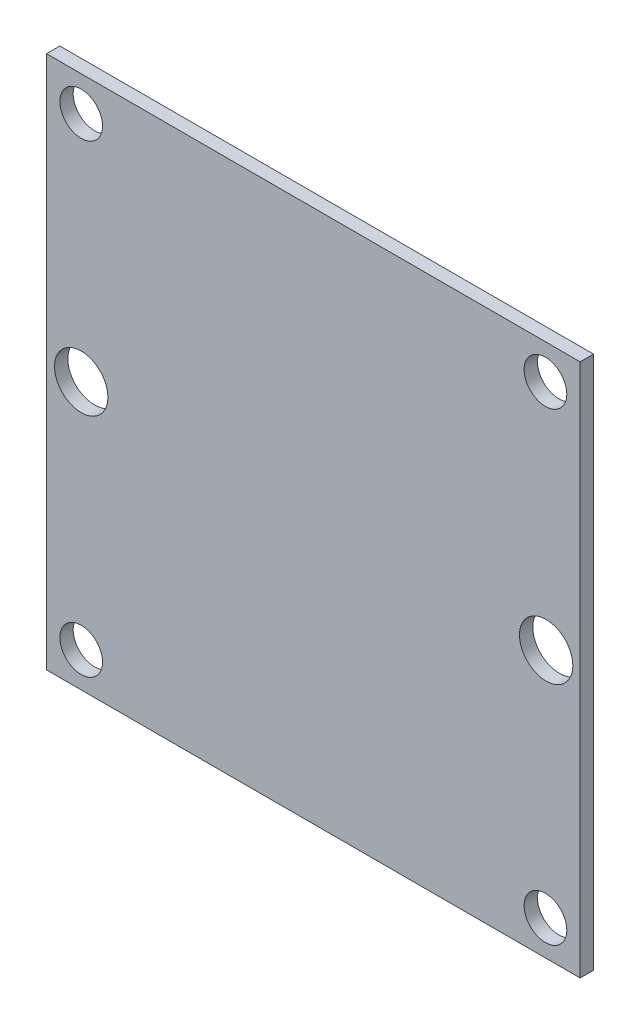
ISO-10303-21;
HEADER;
FILE_DESCRIPTION(('STEP AP214'),'2;1');
FILE_NAME('part.step','',(''),(''),'','','');
FILE_SCHEMA(('AUTOMOTIVE_DESIGN { 1 0 10303 214 1 1 1 1 }'));
ENDSEC;
DATA;
#1=APPLICATION_CONTEXT('core data for automotive mechanical design processes');
#2=APPLICATION_PROTOCOL_DEFINITION('international standard','automotive_design',2000,#1);
#3=PRODUCT_CONTEXT('',#1,'mechanical');
#4=PRODUCT('Part','Part','',(#3));
#5=PRODUCT_RELATED_PRODUCT_CATEGORY('part','',(#4));
#6=PRODUCT_DEFINITION_FORMATION('','',#4);
#7=PRODUCT_DEFINITION_CONTEXT('part definition',#1,'design');
#8=PRODUCT_DEFINITION('design','',#6,#7);
#9=PRODUCT_DEFINITION_SHAPE('','',#8);
#10=(LENGTH_UNIT() NAMED_UNIT(*) SI_UNIT(.MILLI.,.METRE.));
#11=(NAMED_UNIT(*) PLANE_ANGLE_UNIT() SI_UNIT($,.RADIAN.));
#12=(NAMED_UNIT(*) SI_UNIT($,.STERADIAN.) SOLID_ANGLE_UNIT());
#13=UNCERTAINTY_MEASURE_WITH_UNIT(LENGTH_MEASURE(1.E-05),#10,'distance_accuracy_value','');
#14=(GEOMETRIC_REPRESENTATION_CONTEXT(3) GLOBAL_UNCERTAINTY_ASSIGNED_CONTEXT((#13)) GLOBAL_UNIT_ASSIGNED_CONTEXT((#10,
#11,#12)) REPRESENTATION_CONTEXT('',''));
#15=CARTESIAN_POINT('',(0.,0.,0.));
#16=DIRECTION('',(0.,0.,1.));
#17=DIRECTION('',(1.,0.,0.));
#18=AXIS2_PLACEMENT_3D('',#15,#16,#17);
#19=CARTESIAN_POINT('',(20.,20.,1.));
#20=DIRECTION('',(-1.,0.,0.));
#21=DIRECTION('',(0.,0.,1.));
#22=AXIS2_PLACEMENT_3D('',#19,#20,#21);
#23=PLANE('',#22);
#24=DIRECTION('',(0.,1.,0.));
#25=VECTOR('',#24,1.);
#26=CARTESIAN_POINT('',(20.,20.,0.));
#27=LINE('',#26,#25);
#28=CARTESIAN_POINT('',(20.,-20.,0.));
#29=VERTEX_POINT('',#28);
#30=CARTESIAN_POINT('',(20.,20.,0.));
#31=VERTEX_POINT('',#30);
#32=EDGE_CURVE('E98',#29,#31,#27,.T.);
#33=ORIENTED_EDGE('',*,*,#32,.T.);
#34=DIRECTION('',(0.,0.,-1.));
#35=VECTOR('',#34,1.);
#36=CARTESIAN_POINT('',(20.,20.,1.));
#37=LINE('',#36,#35);
#38=CARTESIAN_POINT('',(20.,20.,1.));
#39=VERTEX_POINT('',#38);
#40=EDGE_CURVE('E11',#39,#31,#37,.T.);
#41=ORIENTED_EDGE('',*,*,#40,.F.);
#42=DIRECTION('',(0.,1.,0.));
#43=VECTOR('',#42,1.);
#44=CARTESIAN_POINT('',(20.,20.,1.));
#45=LINE('',#44,#43);
#46=CARTESIAN_POINT('',(20.,-20.,1.));
#47=VERTEX_POINT('',#46);
#48=EDGE_CURVE('E85',#47,#39,#45,.T.);
#49=ORIENTED_EDGE('',*,*,#48,.F.);
#50=DIRECTION('',(0.,0.,-1.));
#51=VECTOR('',#50,1.);
#52=CARTESIAN_POINT('',(20.,-20.,1.));
#53=LINE('',#52,#51);
#54=EDGE_CURVE('E94',#47,#29,#53,.T.);
#55=ORIENTED_EDGE('',*,*,#54,.T.);
#56=EDGE_LOOP('',(#33,#41,#49,#55));
#57=FACE_BOUND('',#56,.T.);
#58=ADVANCED_FACE('F32',(#57),#23,.F.);
#59=CARTESIAN_POINT('',(-20.,20.,1.));
#60=DIRECTION('',(0.,-1.,0.));
#61=DIRECTION('',(0.,0.,-1.));
#62=AXIS2_PLACEMENT_3D('',#59,#60,#61);
#63=PLANE('',#62);
#64=DIRECTION('',(-1.,0.,0.));
#65=VECTOR('',#64,1.);
#66=CARTESIAN_POINT('',(-20.,20.,0.));
#67=LINE('',#66,#65);
#68=CARTESIAN_POINT('',(-20.,20.,0.));
#69=VERTEX_POINT('',#68);
#70=EDGE_CURVE('E89',#31,#69,#67,.T.);
#71=ORIENTED_EDGE('',*,*,#70,.T.);
#72=DIRECTION('',(0.,0.,-1.));
#73=VECTOR('',#72,1.);
#74=CARTESIAN_POINT('',(-20.,20.,1.));
#75=LINE('',#74,#73);
#76=CARTESIAN_POINT('',(-20.,20.,1.));
#77=VERTEX_POINT('',#76);
#78=EDGE_CURVE('E41',#77,#69,#75,.T.);
#79=ORIENTED_EDGE('',*,*,#78,.F.);
#80=DIRECTION('',(-1.,0.,0.));
#81=VECTOR('',#80,1.);
#82=CARTESIAN_POINT('',(-20.,20.,1.));
#83=LINE('',#82,#81);
#84=EDGE_CURVE('E80',#39,#77,#83,.T.);
#85=ORIENTED_EDGE('',*,*,#84,.F.);
#86=ORIENTED_EDGE('',*,*,#40,.T.);
#87=EDGE_LOOP('',(#71,#79,#85,#86));
#88=FACE_BOUND('',#87,.T.);
#89=ADVANCED_FACE('F88',(#88),#63,.F.);
#90=CARTESIAN_POINT('',(-20.,20.,1.));
#91=DIRECTION('',(1.,0.,0.));
#92=DIRECTION('',(0.,1.,0.));
#93=AXIS2_PLACEMENT_3D('',#90,#91,#92);
#94=PLANE('',#93);
#95=DIRECTION('',(0.,-1.,0.));
#96=VECTOR('',#95,1.);
#97=CARTESIAN_POINT('',(-20.,20.,0.));
#98=LINE('',#97,#96);
#99=CARTESIAN_POINT('',(-20.,-20.,0.));
#100=VERTEX_POINT('',#99);
#101=EDGE_CURVE('E67',#69,#100,#98,.T.);
#102=ORIENTED_EDGE('',*,*,#101,.T.);
#103=DIRECTION('',(0.,0.,-1.));
#104=VECTOR('',#103,1.);
#105=CARTESIAN_POINT('',(-20.,-20.,1.));
#106=LINE('',#105,#104);
#107=CARTESIAN_POINT('',(-20.,-20.,1.));
#108=VERTEX_POINT('',#107);
#109=EDGE_CURVE('E90',#108,#100,#106,.T.);
#110=ORIENTED_EDGE('',*,*,#109,.F.);
#111=DIRECTION('',(0.,-1.,0.));
#112=VECTOR('',#111,1.);
#113=CARTESIAN_POINT('',(-20.,20.,1.));
#114=LINE('',#113,#112);
#115=EDGE_CURVE('E83',#77,#108,#114,.T.);
#116=ORIENTED_EDGE('',*,*,#115,.F.);
#117=ORIENTED_EDGE('',*,*,#78,.T.);
#118=EDGE_LOOP('',(#102,#110,#116,#117));
#119=FACE_BOUND('',#118,.T.);
#120=ADVANCED_FACE('F92',(#119),#94,.F.);
#121=CARTESIAN_POINT('',(-20.,-20.,1.));
#122=DIRECTION('',(0.,1.,0.));
#123=DIRECTION('',(0.,0.,1.));
#124=AXIS2_PLACEMENT_3D('',#121,#122,#123);
#125=PLANE('',#124);
#126=DIRECTION('',(1.,0.,0.));
#127=VECTOR('',#126,1.);
#128=CARTESIAN_POINT('',(-20.,-20.,0.));
#129=LINE('',#128,#127);
#130=EDGE_CURVE('E73',#100,#29,#129,.T.);
#131=ORIENTED_EDGE('',*,*,#130,.T.);
#132=ORIENTED_EDGE('',*,*,#54,.F.);
#133=DIRECTION('',(1.,0.,0.));
#134=VECTOR('',#133,1.);
#135=CARTESIAN_POINT('',(-20.,-20.,1.));
#136=LINE('',#135,#134);
#137=EDGE_CURVE('E50',#108,#47,#136,.T.);
#138=ORIENTED_EDGE('',*,*,#137,.F.);
#139=ORIENTED_EDGE('',*,*,#109,.T.);
#140=EDGE_LOOP('',(#131,#132,#138,#139));
#141=FACE_BOUND('',#140,.T.);
#142=ADVANCED_FACE('F148',(#141),#125,.F.);
#143=CARTESIAN_POINT('',(0.,0.,1.));
#144=DIRECTION('',(0.,0.,1.));
#145=DIRECTION('',(1.,0.,0.));
#146=AXIS2_PLACEMENT_3D('',#143,#144,#145);
#147=PLANE('',#146);
#148=CARTESIAN_POINT('',(-17.4,0.,1.));
#149=DIRECTION('',(0.,0.,1.));
#150=DIRECTION('',(1.,0.,0.));
#151=AXIS2_PLACEMENT_3D('',#148,#149,#150);
#152=CIRCLE('',#151,2.);
#153=CARTESIAN_POINT('',(-15.4,0.,1.));
#154=VERTEX_POINT('',#153);
#155=EDGE_CURVE('E133',#154,#154,#152,.T.);
#156=ORIENTED_EDGE('',*,*,#155,.F.);
#157=EDGE_LOOP('',(#156));
#158=FACE_BOUND('',#157,.T.);
#159=CARTESIAN_POINT('',(17.4506505270837,0.,1.));
#160=DIRECTION('',(0.,0.,1.));
#161=DIRECTION('',(1.,0.,0.));
#162=AXIS2_PLACEMENT_3D('',#159,#160,#161);
#163=CIRCLE('',#162,2.);
#164=CARTESIAN_POINT('',(19.4506505270837,0.,1.));
#165=VERTEX_POINT('',#164);
#166=EDGE_CURVE('E123',#165,#165,#163,.T.);
#167=ORIENTED_EDGE('',*,*,#166,.F.);
#168=EDGE_LOOP('',(#167));
#169=FACE_BOUND('',#168,.T.);
#170=CARTESIAN_POINT('',(-17.4,17.4,1.));
#171=DIRECTION('',(0.,0.,1.));
#172=DIRECTION('',(1.,0.,0.));
#173=AXIS2_PLACEMENT_3D('',#170,#171,#172);
#174=CIRCLE('',#173,1.6);
#175=CARTESIAN_POINT('',(-15.8,17.4,1.));
#176=VERTEX_POINT('',#175);
#177=EDGE_CURVE('E120',#176,#176,#174,.T.);
#178=ORIENTED_EDGE('',*,*,#177,.F.);
#179=EDGE_LOOP('',(#178));
#180=FACE_BOUND('',#179,.T.);
#181=CARTESIAN_POINT('',(17.4,17.4,1.));
#182=DIRECTION('',(0.,0.,1.));
#183=DIRECTION('',(1.,0.,0.));
#184=AXIS2_PLACEMENT_3D('',#181,#182,#183);
#185=CIRCLE('',#184,1.6);
#186=CARTESIAN_POINT('',(19.,17.4,1.));
#187=VERTEX_POINT('',#186);
#188=EDGE_CURVE('E117',#187,#187,#185,.T.);
#189=ORIENTED_EDGE('',*,*,#188,.F.);
#190=EDGE_LOOP('',(#189));
#191=FACE_BOUND('',#190,.T.);
#192=CARTESIAN_POINT('',(17.4,-17.4,1.));
#193=DIRECTION('',(0.,0.,1.));
#194=DIRECTION('',(1.,0.,0.));
#195=AXIS2_PLACEMENT_3D('',#192,#193,#194);
#196=CIRCLE('',#195,1.6);
#197=CARTESIAN_POINT('',(19.,-17.4,1.));
#198=VERTEX_POINT('',#197);
#199=EDGE_CURVE('E113',#198,#198,#196,.T.);
#200=ORIENTED_EDGE('',*,*,#199,.F.);
#201=EDGE_LOOP('',(#200));
#202=FACE_BOUND('',#201,.T.);
#203=CARTESIAN_POINT('',(-17.4,-17.4,1.));
#204=DIRECTION('',(0.,0.,1.));
#205=DIRECTION('',(1.,0.,0.));
#206=AXIS2_PLACEMENT_3D('',#203,#204,#205);
#207=CIRCLE('',#206,1.6);
#208=CARTESIAN_POINT('',(-15.8,-17.4,1.));
#209=VERTEX_POINT('',#208);
#210=EDGE_CURVE('E109',#209,#209,#207,.T.);
#211=ORIENTED_EDGE('',*,*,#210,.F.);
#212=EDGE_LOOP('',(#211));
#213=FACE_BOUND('',#212,.T.);
#214=ORIENTED_EDGE('',*,*,#48,.T.);
#215=ORIENTED_EDGE('',*,*,#84,.T.);
#216=ORIENTED_EDGE('',*,*,#115,.T.);
#217=ORIENTED_EDGE('',*,*,#137,.T.);
#218=EDGE_LOOP('',(#214,#215,#216,#217));
#219=FACE_BOUND('',#218,.T.);
#220=ADVANCED_FACE('F81',(#158,#169,#180,#191,#202,#213,#219),#147,.T.);
#221=CARTESIAN_POINT('',(0.,0.,0.));
#222=DIRECTION('',(0.,0.,1.));
#223=DIRECTION('',(1.,0.,0.));
#224=AXIS2_PLACEMENT_3D('',#221,#222,#223);
#225=PLANE('',#224);
#226=CARTESIAN_POINT('',(-17.4,0.,0.));
#227=DIRECTION('',(0.,0.,1.));
#228=DIRECTION('',(1.,0.,0.));
#229=AXIS2_PLACEMENT_3D('',#226,#227,#228);
#230=CIRCLE('',#229,2.);
#231=CARTESIAN_POINT('',(-15.4,0.,0.));
#232=VERTEX_POINT('',#231);
#233=EDGE_CURVE('E35',#232,#232,#230,.T.);
#234=ORIENTED_EDGE('',*,*,#233,.T.);
#235=EDGE_LOOP('',(#234));
#236=FACE_BOUND('',#235,.T.);
#237=CARTESIAN_POINT('',(17.4506505270837,0.,0.));
#238=DIRECTION('',(0.,0.,1.));
#239=DIRECTION('',(1.,0.,0.));
#240=AXIS2_PLACEMENT_3D('',#237,#238,#239);
#241=CIRCLE('',#240,2.);
#242=CARTESIAN_POINT('',(19.4506505270837,0.,0.));
#243=VERTEX_POINT('',#242);
#244=EDGE_CURVE('E121',#243,#243,#241,.T.);
#245=ORIENTED_EDGE('',*,*,#244,.T.);
#246=EDGE_LOOP('',(#245));
#247=FACE_BOUND('',#246,.T.);
#248=CARTESIAN_POINT('',(-17.4,17.4,0.));
#249=DIRECTION('',(0.,0.,1.));
#250=DIRECTION('',(1.,0.,0.));
#251=AXIS2_PLACEMENT_3D('',#248,#249,#250);
#252=CIRCLE('',#251,1.6);
#253=CARTESIAN_POINT('',(-15.8,17.4,0.));
#254=VERTEX_POINT('',#253);
#255=EDGE_CURVE('E118',#254,#254,#252,.T.);
#256=ORIENTED_EDGE('',*,*,#255,.T.);
#257=EDGE_LOOP('',(#256));
#258=FACE_BOUND('',#257,.T.);
#259=CARTESIAN_POINT('',(17.4,17.4,0.));
#260=DIRECTION('',(0.,0.,1.));
#261=DIRECTION('',(1.,0.,0.));
#262=AXIS2_PLACEMENT_3D('',#259,#260,#261);
#263=CIRCLE('',#262,1.6);
#264=CARTESIAN_POINT('',(19.,17.4,0.));
#265=VERTEX_POINT('',#264);
#266=EDGE_CURVE('E114',#265,#265,#263,.T.);
#267=ORIENTED_EDGE('',*,*,#266,.T.);
#268=EDGE_LOOP('',(#267));
#269=FACE_BOUND('',#268,.T.);
#270=CARTESIAN_POINT('',(17.4,-17.4,0.));
#271=DIRECTION('',(0.,0.,1.));
#272=DIRECTION('',(1.,0.,0.));
#273=AXIS2_PLACEMENT_3D('',#270,#271,#272);
#274=CIRCLE('',#273,1.6);
#275=CARTESIAN_POINT('',(19.,-17.4,0.));
#276=VERTEX_POINT('',#275);
#277=EDGE_CURVE('E110',#276,#276,#274,.T.);
#278=ORIENTED_EDGE('',*,*,#277,.T.);
#279=EDGE_LOOP('',(#278));
#280=FACE_BOUND('',#279,.T.);
#281=CARTESIAN_POINT('',(-17.4,-17.4,0.));
#282=DIRECTION('',(0.,0.,1.));
#283=DIRECTION('',(1.,0.,0.));
#284=AXIS2_PLACEMENT_3D('',#281,#282,#283);
#285=CIRCLE('',#284,1.6);
#286=CARTESIAN_POINT('',(-15.8,-17.4,0.));
#287=VERTEX_POINT('',#286);
#288=EDGE_CURVE('E101',#287,#287,#285,.T.);
#289=ORIENTED_EDGE('',*,*,#288,.T.);
#290=EDGE_LOOP('',(#289));
#291=FACE_BOUND('',#290,.T.);
#292=ORIENTED_EDGE('',*,*,#32,.F.);
#293=ORIENTED_EDGE('',*,*,#130,.F.);
#294=ORIENTED_EDGE('',*,*,#101,.F.);
#295=ORIENTED_EDGE('',*,*,#70,.F.);
#296=EDGE_LOOP('',(#292,#293,#294,#295));
#297=FACE_BOUND('',#296,.T.);
#298=ADVANCED_FACE('F147',(#236,#247,#258,#269,#280,#291,#297),#225,.F.);
#299=CARTESIAN_POINT('',(-17.4,-17.4,-9.));
#300=DIRECTION('',(0.,0.,1.));
#301=DIRECTION('',(1.,0.,0.));
#302=AXIS2_PLACEMENT_3D('',#299,#300,#301);
#303=CYLINDRICAL_SURFACE('',#302,1.6);
#304=ORIENTED_EDGE('',*,*,#210,.T.);
#305=EDGE_LOOP('',(#304));
#306=FACE_BOUND('',#305,.T.);
#307=ORIENTED_EDGE('',*,*,#288,.F.);
#308=EDGE_LOOP('',(#307));
#309=FACE_BOUND('',#308,.T.);
#310=ADVANCED_FACE('F143',(#306,#309),#303,.F.);
#311=CARTESIAN_POINT('',(17.4,-17.4,-9.));
#312=DIRECTION('',(0.,0.,1.));
#313=DIRECTION('',(1.,0.,0.));
#314=AXIS2_PLACEMENT_3D('',#311,#312,#313);
#315=CYLINDRICAL_SURFACE('',#314,1.6);
#316=ORIENTED_EDGE('',*,*,#199,.T.);
#317=EDGE_LOOP('',(#316));
#318=FACE_BOUND('',#317,.T.);
#319=ORIENTED_EDGE('',*,*,#277,.F.);
#320=EDGE_LOOP('',(#319));
#321=FACE_BOUND('',#320,.T.);
#322=ADVANCED_FACE('F197',(#318,#321),#315,.F.);
#323=CARTESIAN_POINT('',(17.4,17.4,-9.));
#324=DIRECTION('',(0.,0.,1.));
#325=DIRECTION('',(1.,0.,0.));
#326=AXIS2_PLACEMENT_3D('',#323,#324,#325);
#327=CYLINDRICAL_SURFACE('',#326,1.6);
#328=ORIENTED_EDGE('',*,*,#188,.T.);
#329=EDGE_LOOP('',(#328));
#330=FACE_BOUND('',#329,.T.);
#331=ORIENTED_EDGE('',*,*,#266,.F.);
#332=EDGE_LOOP('',(#331));
#333=FACE_BOUND('',#332,.T.);
#334=ADVANCED_FACE('F205',(#330,#333),#327,.F.);
#335=CARTESIAN_POINT('',(-17.4,17.4,-9.));
#336=DIRECTION('',(0.,0.,1.));
#337=DIRECTION('',(1.,0.,0.));
#338=AXIS2_PLACEMENT_3D('',#335,#336,#337);
#339=CYLINDRICAL_SURFACE('',#338,1.6);
#340=ORIENTED_EDGE('',*,*,#177,.T.);
#341=EDGE_LOOP('',(#340));
#342=FACE_BOUND('',#341,.T.);
#343=ORIENTED_EDGE('',*,*,#255,.F.);
#344=EDGE_LOOP('',(#343));
#345=FACE_BOUND('',#344,.T.);
#346=ADVANCED_FACE('F215',(#342,#345),#339,.F.);
#347=CARTESIAN_POINT('',(17.4506505270837,0.,-9.));
#348=DIRECTION('',(0.,0.,1.));
#349=DIRECTION('',(1.,0.,0.));
#350=AXIS2_PLACEMENT_3D('',#347,#348,#349);
#351=CYLINDRICAL_SURFACE('',#350,2.);
#352=ORIENTED_EDGE('',*,*,#166,.T.);
#353=EDGE_LOOP('',(#352));
#354=FACE_BOUND('',#353,.T.);
#355=ORIENTED_EDGE('',*,*,#244,.F.);
#356=EDGE_LOOP('',(#355));
#357=FACE_BOUND('',#356,.T.);
#358=ADVANCED_FACE('F225',(#354,#357),#351,.F.);
#359=CARTESIAN_POINT('',(-17.4,0.,-9.));
#360=DIRECTION('',(0.,0.,1.));
#361=DIRECTION('',(1.,0.,0.));
#362=AXIS2_PLACEMENT_3D('',#359,#360,#361);
#363=CYLINDRICAL_SURFACE('',#362,2.);
#364=ORIENTED_EDGE('',*,*,#155,.T.);
#365=EDGE_LOOP('',(#364));
#366=FACE_BOUND('',#365,.T.);
#367=ORIENTED_EDGE('',*,*,#233,.F.);
#368=EDGE_LOOP('',(#367));
#369=FACE_BOUND('',#368,.T.);
#370=ADVANCED_FACE('F235',(#366,#369),#363,.F.);
#371=CLOSED_SHELL('',(#58,#89,#120,#142,#220,#298,#310,#322,#334,#346,#358,#370));
#372=MANIFOLD_SOLID_BREP('B2',#371);
#373=ADVANCED_BREP_SHAPE_REPRESENTATION('',(#18,#372),#14);
#374=SHAPE_DEFINITION_REPRESENTATION(#9,#373);
ENDSEC;
END-ISO-10303-21;
